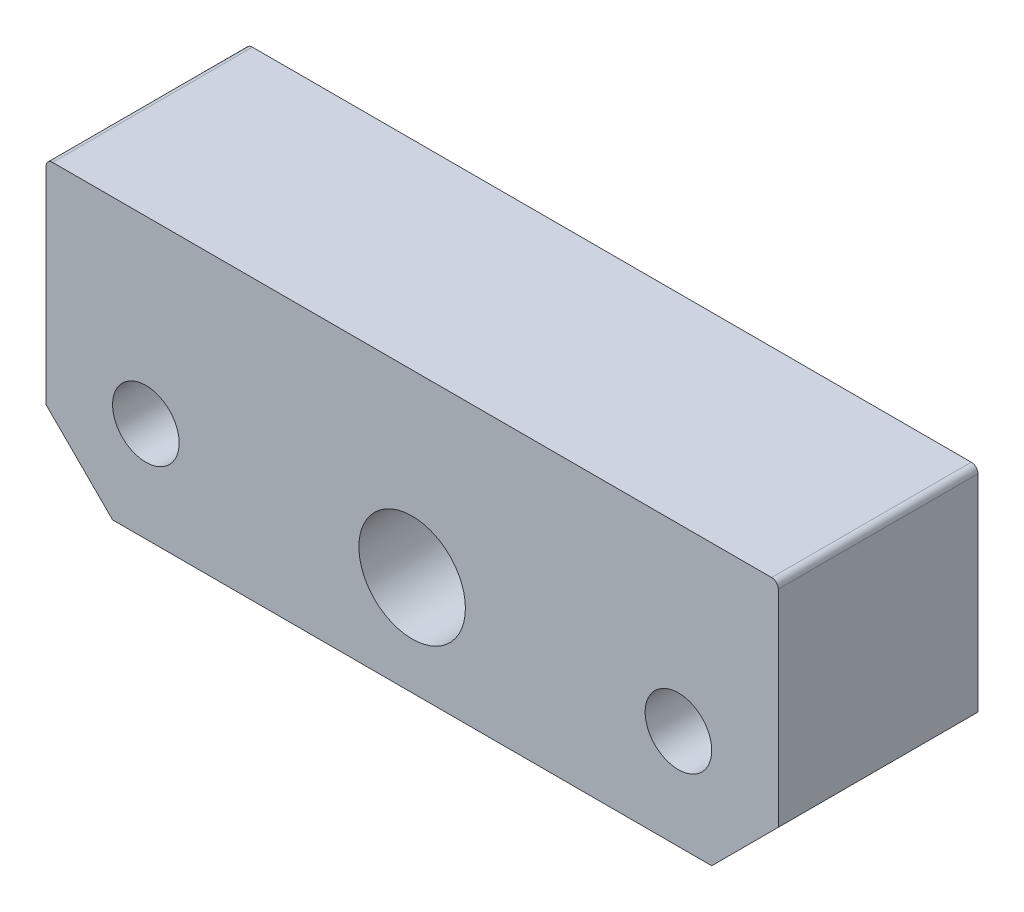
ISO-10303-21;
HEADER;
FILE_DESCRIPTION(('STEP AP214'),'2;1');
FILE_NAME('part.step','',(''),(''),'','','');
FILE_SCHEMA(('AUTOMOTIVE_DESIGN { 1 0 10303 214 1 1 1 1 }'));
ENDSEC;
DATA;
#1=APPLICATION_CONTEXT('core data for automotive mechanical design processes');
#2=APPLICATION_PROTOCOL_DEFINITION('international standard','automotive_design',2000,#1);
#3=PRODUCT_CONTEXT('',#1,'mechanical');
#4=PRODUCT('Part','Part','',(#3));
#5=PRODUCT_RELATED_PRODUCT_CATEGORY('part','',(#4));
#6=PRODUCT_DEFINITION_FORMATION('','',#4);
#7=PRODUCT_DEFINITION_CONTEXT('part definition',#1,'design');
#8=PRODUCT_DEFINITION('design','',#6,#7);
#9=PRODUCT_DEFINITION_SHAPE('','',#8);
#10=(LENGTH_UNIT() NAMED_UNIT(*) SI_UNIT(.MILLI.,.METRE.));
#11=(NAMED_UNIT(*) PLANE_ANGLE_UNIT() SI_UNIT($,.RADIAN.));
#12=(NAMED_UNIT(*) SI_UNIT($,.STERADIAN.) SOLID_ANGLE_UNIT());
#13=UNCERTAINTY_MEASURE_WITH_UNIT(LENGTH_MEASURE(1.E-05),#10,'distance_accuracy_value','');
#14=(GEOMETRIC_REPRESENTATION_CONTEXT(3) GLOBAL_UNCERTAINTY_ASSIGNED_CONTEXT((#13)) GLOBAL_UNIT_ASSIGNED_CONTEXT((#10,
#11,#12)) REPRESENTATION_CONTEXT('',''));
#15=CARTESIAN_POINT('',(0.,0.,0.));
#16=DIRECTION('',(0.,0.,1.));
#17=DIRECTION('',(1.,0.,0.));
#18=AXIS2_PLACEMENT_3D('',#15,#16,#17);
#19=CARTESIAN_POINT('',(55.,-21.,30.));
#20=DIRECTION('',(-1.,0.,0.));
#21=DIRECTION('',(0.,0.,1.));
#22=AXIS2_PLACEMENT_3D('',#19,#20,#21);
#23=PLANE('',#22);
#24=DIRECTION('',(0.,1.,0.));
#25=VECTOR('',#24,1.);
#26=CARTESIAN_POINT('',(55.,-21.,0.));
#27=LINE('',#26,#25);
#28=CARTESIAN_POINT('',(55.,-11.,0.));
#29=VERTEX_POINT('',#28);
#30=CARTESIAN_POINT('',(55.,20.,0.));
#31=VERTEX_POINT('',#30);
#32=EDGE_CURVE('E169',#29,#31,#27,.T.);
#33=ORIENTED_EDGE('',*,*,#32,.T.);
#34=DIRECTION('',(0.,0.,-1.));
#35=VECTOR('',#34,1.);
#36=CARTESIAN_POINT('',(55.,20.,30.));
#37=LINE('',#36,#35);
#38=CARTESIAN_POINT('',(55.,20.,30.));
#39=VERTEX_POINT('',#38);
#40=EDGE_CURVE('E11',#31,#39,#37,.F.);
#41=ORIENTED_EDGE('',*,*,#40,.T.);
#42=DIRECTION('',(0.,1.,0.));
#43=VECTOR('',#42,1.);
#44=CARTESIAN_POINT('',(55.,-21.,30.));
#45=LINE('',#44,#43);
#46=CARTESIAN_POINT('',(55.,-11.,30.));
#47=VERTEX_POINT('',#46);
#48=EDGE_CURVE('E124',#47,#39,#45,.T.);
#49=ORIENTED_EDGE('',*,*,#48,.F.);
#50=DIRECTION('',(0.,0.,-1.));
#51=VECTOR('',#50,1.);
#52=CARTESIAN_POINT('',(55.,-11.,30.));
#53=LINE('',#52,#51);
#54=EDGE_CURVE('E140',#47,#29,#53,.T.);
#55=ORIENTED_EDGE('',*,*,#54,.T.);
#56=EDGE_LOOP('',(#33,#41,#49,#55));
#57=FACE_BOUND('',#56,.T.);
#58=ADVANCED_FACE('F32',(#57),#23,.F.);
#59=CARTESIAN_POINT('',(-55.,21.,30.));
#60=DIRECTION('',(0.,-1.,0.));
#61=DIRECTION('',(0.,0.,-1.));
#62=AXIS2_PLACEMENT_3D('',#59,#60,#61);
#63=PLANE('',#62);
#64=DIRECTION('',(-1.,0.,0.));
#65=VECTOR('',#64,1.);
#66=CARTESIAN_POINT('',(-55.,21.,0.));
#67=LINE('',#66,#65);
#68=CARTESIAN_POINT('',(54.,21.,0.));
#69=VERTEX_POINT('',#68);
#70=CARTESIAN_POINT('',(-54.,21.,0.));
#71=VERTEX_POINT('',#70);
#72=EDGE_CURVE('E129',#69,#71,#67,.T.);
#73=ORIENTED_EDGE('',*,*,#72,.T.);
#74=DIRECTION('',(0.,0.,-1.));
#75=VECTOR('',#74,1.);
#76=CARTESIAN_POINT('',(-54.,21.,30.));
#77=LINE('',#76,#75);
#78=CARTESIAN_POINT('',(-54.,21.,30.));
#79=VERTEX_POINT('',#78);
#80=EDGE_CURVE('E53',#71,#79,#77,.F.);
#81=ORIENTED_EDGE('',*,*,#80,.T.);
#82=DIRECTION('',(-1.,0.,0.));
#83=VECTOR('',#82,1.);
#84=CARTESIAN_POINT('',(-55.,21.,30.));
#85=LINE('',#84,#83);
#86=CARTESIAN_POINT('',(54.,21.,30.));
#87=VERTEX_POINT('',#86);
#88=EDGE_CURVE('E127',#87,#79,#85,.T.);
#89=ORIENTED_EDGE('',*,*,#88,.F.);
#90=DIRECTION('',(0.,0.,-1.));
#91=VECTOR('',#90,1.);
#92=CARTESIAN_POINT('',(54.,21.,30.));
#93=LINE('',#92,#91);
#94=EDGE_CURVE('E150',#87,#69,#93,.T.);
#95=ORIENTED_EDGE('',*,*,#94,.T.);
#96=EDGE_LOOP('',(#73,#81,#89,#95));
#97=FACE_BOUND('',#96,.T.);
#98=ADVANCED_FACE('F167',(#97),#63,.F.);
#99=CARTESIAN_POINT('',(-55.,-21.,30.));
#100=DIRECTION('',(1.,0.,0.));
#101=DIRECTION('',(0.,0.,-1.));
#102=AXIS2_PLACEMENT_3D('',#99,#100,#101);
#103=PLANE('',#102);
#104=DIRECTION('',(0.,-1.,0.));
#105=VECTOR('',#104,1.);
#106=CARTESIAN_POINT('',(-55.,-21.,30.));
#107=LINE('',#106,#105);
#108=CARTESIAN_POINT('',(-55.,20.,30.));
#109=VERTEX_POINT('',#108);
#110=CARTESIAN_POINT('',(-55.,-11.,30.));
#111=VERTEX_POINT('',#110);
#112=EDGE_CURVE('E159',#109,#111,#107,.T.);
#113=ORIENTED_EDGE('',*,*,#112,.F.);
#114=DIRECTION('',(0.,0.,-1.));
#115=VECTOR('',#114,1.);
#116=CARTESIAN_POINT('',(-55.,20.,30.));
#117=LINE('',#116,#115);
#118=CARTESIAN_POINT('',(-55.,20.,0.));
#119=VERTEX_POINT('',#118);
#120=EDGE_CURVE('E143',#109,#119,#117,.T.);
#121=ORIENTED_EDGE('',*,*,#120,.T.);
#122=DIRECTION('',(0.,-1.,0.));
#123=VECTOR('',#122,1.);
#124=CARTESIAN_POINT('',(-55.,-21.,0.));
#125=LINE('',#124,#123);
#126=CARTESIAN_POINT('',(-55.,-11.,0.));
#127=VERTEX_POINT('',#126);
#128=EDGE_CURVE('E125',#119,#127,#125,.T.);
#129=ORIENTED_EDGE('',*,*,#128,.T.);
#130=DIRECTION('',(0.,0.,1.));
#131=VECTOR('',#130,1.);
#132=CARTESIAN_POINT('',(-55.,-10.9999999999999,30.));
#133=LINE('',#132,#131);
#134=EDGE_CURVE('E106',#127,#111,#133,.T.);
#135=ORIENTED_EDGE('',*,*,#134,.T.);
#136=EDGE_LOOP('',(#113,#121,#129,#135));
#137=FACE_BOUND('',#136,.T.);
#138=ADVANCED_FACE('F163',(#137),#103,.F.);
#139=CARTESIAN_POINT('',(-55.,-21.,30.));
#140=DIRECTION('',(0.,1.,0.));
#141=DIRECTION('',(0.,0.,1.));
#142=AXIS2_PLACEMENT_3D('',#139,#140,#141);
#143=PLANE('',#142);
#144=DIRECTION('',(1.,0.,0.));
#145=VECTOR('',#144,1.);
#146=CARTESIAN_POINT('',(-55.,-21.,30.));
#147=LINE('',#146,#145);
#148=CARTESIAN_POINT('',(-45.,-21.,30.));
#149=VERTEX_POINT('',#148);
#150=CARTESIAN_POINT('',(45.,-21.,30.));
#151=VERTEX_POINT('',#150);
#152=EDGE_CURVE('E119',#149,#151,#147,.T.);
#153=ORIENTED_EDGE('',*,*,#152,.F.);
#154=DIRECTION('',(0.,0.,-1.));
#155=VECTOR('',#154,1.);
#156=CARTESIAN_POINT('',(-45.,-21.,30.));
#157=LINE('',#156,#155);
#158=CARTESIAN_POINT('',(-45.,-21.,0.));
#159=VERTEX_POINT('',#158);
#160=EDGE_CURVE('E104',#149,#159,#157,.T.);
#161=ORIENTED_EDGE('',*,*,#160,.T.);
#162=DIRECTION('',(1.,0.,0.));
#163=VECTOR('',#162,1.);
#164=CARTESIAN_POINT('',(-55.,-21.,0.));
#165=LINE('',#164,#163);
#166=CARTESIAN_POINT('',(45.,-21.,0.));
#167=VERTEX_POINT('',#166);
#168=EDGE_CURVE('E116',#159,#167,#165,.T.);
#169=ORIENTED_EDGE('',*,*,#168,.T.);
#170=DIRECTION('',(0.,0.,1.));
#171=VECTOR('',#170,1.);
#172=CARTESIAN_POINT('',(45.,-21.,30.));
#173=LINE('',#172,#171);
#174=EDGE_CURVE('E120',#167,#151,#173,.T.);
#175=ORIENTED_EDGE('',*,*,#174,.T.);
#176=EDGE_LOOP('',(#153,#161,#169,#175));
#177=FACE_BOUND('',#176,.T.);
#178=ADVANCED_FACE('F115',(#177),#143,.F.);
#179=CARTESIAN_POINT('',(0.,0.,30.));
#180=DIRECTION('',(0.,0.,-1.));
#181=DIRECTION('',(-1.,0.,0.));
#182=AXIS2_PLACEMENT_3D('',#179,#180,#181);
#183=PLANE('',#182);
#184=CARTESIAN_POINT('',(40.,-5.99999999999999,30.));
#185=DIRECTION('',(0.,0.,1.));
#186=DIRECTION('',(1.,0.,0.));
#187=AXIS2_PLACEMENT_3D('',#184,#185,#186);
#188=CIRCLE('',#187,5.);
#189=CARTESIAN_POINT('',(45.,-5.99999999999999,30.));
#190=VERTEX_POINT('',#189);
#191=EDGE_CURVE('E187',#190,#190,#188,.T.);
#192=ORIENTED_EDGE('',*,*,#191,.F.);
#193=EDGE_LOOP('',(#192));
#194=FACE_BOUND('',#193,.T.);
#195=CARTESIAN_POINT('',(0.,-5.99999999999999,30.));
#196=DIRECTION('',(0.,0.,1.));
#197=DIRECTION('',(1.,0.,0.));
#198=AXIS2_PLACEMENT_3D('',#195,#196,#197);
#199=CIRCLE('',#198,8.);
#200=CARTESIAN_POINT('',(8.,-5.99999999999999,30.));
#201=VERTEX_POINT('',#200);
#202=EDGE_CURVE('E181',#201,#201,#199,.T.);
#203=ORIENTED_EDGE('',*,*,#202,.F.);
#204=EDGE_LOOP('',(#203));
#205=FACE_BOUND('',#204,.T.);
#206=CARTESIAN_POINT('',(-40.,-5.99999999999999,30.));
#207=DIRECTION('',(0.,0.,1.));
#208=DIRECTION('',(1.,0.,0.));
#209=AXIS2_PLACEMENT_3D('',#206,#207,#208);
#210=CIRCLE('',#209,5.);
#211=CARTESIAN_POINT('',(-35.,-5.99999999999999,30.));
#212=VERTEX_POINT('',#211);
#213=EDGE_CURVE('E175',#212,#212,#210,.T.);
#214=ORIENTED_EDGE('',*,*,#213,.F.);
#215=EDGE_LOOP('',(#214));
#216=FACE_BOUND('',#215,.T.);
#217=ORIENTED_EDGE('',*,*,#88,.T.);
#218=CARTESIAN_POINT('',(-54.,20.,30.));
#219=DIRECTION('',(0.,0.,-1.));
#220=DIRECTION('',(-1.,0.,0.));
#221=AXIS2_PLACEMENT_3D('',#218,#219,#220);
#222=CIRCLE('',#221,1.);
#223=EDGE_CURVE('E40',#79,#109,#222,.F.);
#224=ORIENTED_EDGE('',*,*,#223,.T.);
#225=ORIENTED_EDGE('',*,*,#112,.T.);
#226=DIRECTION('',(-0.707106781186546,0.707106781186549,0.));
#227=VECTOR('',#226,1.);
#228=CARTESIAN_POINT('',(-45.,-21.,30.));
#229=LINE('',#228,#227);
#230=EDGE_CURVE('E138',#111,#149,#229,.F.);
#231=ORIENTED_EDGE('',*,*,#230,.T.);
#232=ORIENTED_EDGE('',*,*,#152,.T.);
#233=DIRECTION('',(-0.707106781186549,-0.707106781186546,0.));
#234=VECTOR('',#233,1.);
#235=CARTESIAN_POINT('',(55.,-11.,30.));
#236=LINE('',#235,#234);
#237=EDGE_CURVE('E136',#151,#47,#236,.F.);
#238=ORIENTED_EDGE('',*,*,#237,.T.);
#239=ORIENTED_EDGE('',*,*,#48,.T.);
#240=CARTESIAN_POINT('',(54.,20.,30.));
#241=DIRECTION('',(0.,0.,-1.));
#242=DIRECTION('',(-1.,0.,0.));
#243=AXIS2_PLACEMENT_3D('',#240,#241,#242);
#244=CIRCLE('',#243,1.);
#245=EDGE_CURVE('E154',#39,#87,#244,.F.);
#246=ORIENTED_EDGE('',*,*,#245,.T.);
#247=EDGE_LOOP('',(#217,#224,#225,#231,#232,#238,#239,#246));
#248=FACE_BOUND('',#247,.T.);
#249=ADVANCED_FACE('F158',(#194,#205,#216,#248),#183,.F.);
#250=CARTESIAN_POINT('',(0.,0.,0.));
#251=DIRECTION('',(0.,0.,-1.));
#252=DIRECTION('',(-1.,0.,0.));
#253=AXIS2_PLACEMENT_3D('',#250,#251,#252);
#254=PLANE('',#253);
#255=CARTESIAN_POINT('',(40.,-5.99999999999999,0.));
#256=DIRECTION('',(0.,0.,1.));
#257=DIRECTION('',(1.,0.,0.));
#258=AXIS2_PLACEMENT_3D('',#255,#256,#257);
#259=CIRCLE('',#258,5.);
#260=CARTESIAN_POINT('',(45.,-5.99999999999999,0.));
#261=VERTEX_POINT('',#260);
#262=EDGE_CURVE('E178',#261,#261,#259,.T.);
#263=ORIENTED_EDGE('',*,*,#262,.T.);
#264=EDGE_LOOP('',(#263));
#265=FACE_BOUND('',#264,.T.);
#266=CARTESIAN_POINT('',(0.,-5.99999999999999,0.));
#267=DIRECTION('',(0.,0.,1.));
#268=DIRECTION('',(1.,0.,0.));
#269=AXIS2_PLACEMENT_3D('',#266,#267,#268);
#270=CIRCLE('',#269,8.);
#271=CARTESIAN_POINT('',(8.,-5.99999999999999,0.));
#272=VERTEX_POINT('',#271);
#273=EDGE_CURVE('E184',#272,#272,#270,.T.);
#274=ORIENTED_EDGE('',*,*,#273,.T.);
#275=EDGE_LOOP('',(#274));
#276=FACE_BOUND('',#275,.T.);
#277=CARTESIAN_POINT('',(-40.,-5.99999999999999,0.));
#278=DIRECTION('',(0.,0.,1.));
#279=DIRECTION('',(1.,0.,0.));
#280=AXIS2_PLACEMENT_3D('',#277,#278,#279);
#281=CIRCLE('',#280,5.);
#282=CARTESIAN_POINT('',(-35.,-5.99999999999999,0.));
#283=VERTEX_POINT('',#282);
#284=EDGE_CURVE('E170',#283,#283,#281,.T.);
#285=ORIENTED_EDGE('',*,*,#284,.T.);
#286=EDGE_LOOP('',(#285));
#287=FACE_BOUND('',#286,.T.);
#288=ORIENTED_EDGE('',*,*,#128,.F.);
#289=CARTESIAN_POINT('',(-54.,20.,0.));
#290=DIRECTION('',(0.,0.,-1.));
#291=DIRECTION('',(-1.,0.,0.));
#292=AXIS2_PLACEMENT_3D('',#289,#290,#291);
#293=CIRCLE('',#292,1.);
#294=EDGE_CURVE('E148',#119,#71,#293,.T.);
#295=ORIENTED_EDGE('',*,*,#294,.T.);
#296=ORIENTED_EDGE('',*,*,#72,.F.);
#297=CARTESIAN_POINT('',(54.,20.,0.));
#298=DIRECTION('',(0.,0.,-1.));
#299=DIRECTION('',(-1.,0.,0.));
#300=AXIS2_PLACEMENT_3D('',#297,#298,#299);
#301=CIRCLE('',#300,1.);
#302=EDGE_CURVE('E146',#69,#31,#301,.T.);
#303=ORIENTED_EDGE('',*,*,#302,.T.);
#304=ORIENTED_EDGE('',*,*,#32,.F.);
#305=DIRECTION('',(0.707106781186549,0.707106781186546,0.));
#306=VECTOR('',#305,1.);
#307=CARTESIAN_POINT('',(32.9999999999999,-33.,0.));
#308=LINE('',#307,#306);
#309=EDGE_CURVE('E110',#29,#167,#308,.F.);
#310=ORIENTED_EDGE('',*,*,#309,.T.);
#311=ORIENTED_EDGE('',*,*,#168,.F.);
#312=DIRECTION('',(0.707106781186546,-0.707106781186549,0.));
#313=VECTOR('',#312,1.);
#314=CARTESIAN_POINT('',(-33.0000000000001,-32.9999999999999,0.));
#315=LINE('',#314,#313);
#316=EDGE_CURVE('E100',#159,#127,#315,.F.);
#317=ORIENTED_EDGE('',*,*,#316,.T.);
#318=EDGE_LOOP('',(#288,#295,#296,#303,#304,#310,#311,#317));
#319=FACE_BOUND('',#318,.T.);
#320=ADVANCED_FACE('F122',(#265,#276,#287,#319),#254,.T.);
#321=CARTESIAN_POINT('',(-45.,-21.,30.));
#322=DIRECTION('',(0.707106781186549,0.707106781186546,0.));
#323=DIRECTION('',(0.,0.,-1.));
#324=AXIS2_PLACEMENT_3D('',#321,#322,#323);
#325=PLANE('',#324);
#326=ORIENTED_EDGE('',*,*,#230,.F.);
#327=ORIENTED_EDGE('',*,*,#134,.F.);
#328=ORIENTED_EDGE('',*,*,#316,.F.);
#329=ORIENTED_EDGE('',*,*,#160,.F.);
#330=EDGE_LOOP('',(#326,#327,#328,#329));
#331=FACE_BOUND('',#330,.T.);
#332=ADVANCED_FACE('F103',(#331),#325,.F.);
#333=CARTESIAN_POINT('',(55.,-11.,30.));
#334=DIRECTION('',(-0.707106781186546,0.707106781186549,0.));
#335=DIRECTION('',(0.,0.,-1.));
#336=AXIS2_PLACEMENT_3D('',#333,#334,#335);
#337=PLANE('',#336);
#338=ORIENTED_EDGE('',*,*,#237,.F.);
#339=ORIENTED_EDGE('',*,*,#174,.F.);
#340=ORIENTED_EDGE('',*,*,#309,.F.);
#341=ORIENTED_EDGE('',*,*,#54,.F.);
#342=EDGE_LOOP('',(#338,#339,#340,#341));
#343=FACE_BOUND('',#342,.T.);
#344=ADVANCED_FACE('F231',(#343),#337,.F.);
#345=CARTESIAN_POINT('',(-54.,20.,30.));
#346=DIRECTION('',(0.,0.,-1.));
#347=DIRECTION('',(-1.,0.,0.));
#348=AXIS2_PLACEMENT_3D('',#345,#346,#347);
#349=CYLINDRICAL_SURFACE('',#348,1.);
#350=ORIENTED_EDGE('',*,*,#223,.F.);
#351=ORIENTED_EDGE('',*,*,#80,.F.);
#352=ORIENTED_EDGE('',*,*,#294,.F.);
#353=ORIENTED_EDGE('',*,*,#120,.F.);
#354=EDGE_LOOP('',(#350,#351,#352,#353));
#355=FACE_BOUND('',#354,.T.);
#356=ADVANCED_FACE('F165',(#355),#349,.T.);
#357=CARTESIAN_POINT('',(54.,20.,30.));
#358=DIRECTION('',(0.,0.,-1.));
#359=DIRECTION('',(-1.,0.,0.));
#360=AXIS2_PLACEMENT_3D('',#357,#358,#359);
#361=CYLINDRICAL_SURFACE('',#360,1.);
#362=ORIENTED_EDGE('',*,*,#245,.F.);
#363=ORIENTED_EDGE('',*,*,#40,.F.);
#364=ORIENTED_EDGE('',*,*,#302,.F.);
#365=ORIENTED_EDGE('',*,*,#94,.F.);
#366=EDGE_LOOP('',(#362,#363,#364,#365));
#367=FACE_BOUND('',#366,.T.);
#368=ADVANCED_FACE('F34',(#367),#361,.T.);
#369=CARTESIAN_POINT('',(-40.,-5.99999999999999,0.));
#370=DIRECTION('',(0.,0.,1.));
#371=DIRECTION('',(1.,0.,0.));
#372=AXIS2_PLACEMENT_3D('',#369,#370,#371);
#373=CYLINDRICAL_SURFACE('',#372,5.);
#374=ORIENTED_EDGE('',*,*,#284,.F.);
#375=EDGE_LOOP('',(#374));
#376=FACE_BOUND('',#375,.T.);
#377=ORIENTED_EDGE('',*,*,#213,.T.);
#378=EDGE_LOOP('',(#377));
#379=FACE_BOUND('',#378,.T.);
#380=ADVANCED_FACE('F209',(#376,#379),#373,.F.);
#381=CARTESIAN_POINT('',(0.,-5.99999999999999,0.));
#382=DIRECTION('',(0.,0.,1.));
#383=DIRECTION('',(1.,0.,0.));
#384=AXIS2_PLACEMENT_3D('',#381,#382,#383);
#385=CYLINDRICAL_SURFACE('',#384,8.);
#386=ORIENTED_EDGE('',*,*,#273,.F.);
#387=EDGE_LOOP('',(#386));
#388=FACE_BOUND('',#387,.T.);
#389=ORIENTED_EDGE('',*,*,#202,.T.);
#390=EDGE_LOOP('',(#389));
#391=FACE_BOUND('',#390,.T.);
#392=ADVANCED_FACE('F198',(#388,#391),#385,.F.);
#393=CARTESIAN_POINT('',(40.,-5.99999999999999,0.));
#394=DIRECTION('',(0.,0.,1.));
#395=DIRECTION('',(1.,0.,0.));
#396=AXIS2_PLACEMENT_3D('',#393,#394,#395);
#397=CYLINDRICAL_SURFACE('',#396,5.);
#398=ORIENTED_EDGE('',*,*,#262,.F.);
#399=EDGE_LOOP('',(#398));
#400=FACE_BOUND('',#399,.T.);
#401=ORIENTED_EDGE('',*,*,#191,.T.);
#402=EDGE_LOOP('',(#401));
#403=FACE_BOUND('',#402,.T.);
#404=ADVANCED_FACE('F195',(#400,#403),#397,.F.);
#405=CLOSED_SHELL('',(#58,#98,#138,#178,#249,#320,#332,#344,#356,#368,#380,#392,#404));
#406=MANIFOLD_SOLID_BREP('B2',#405);
#407=ADVANCED_BREP_SHAPE_REPRESENTATION('',(#18,#406),#14);
#408=SHAPE_DEFINITION_REPRESENTATION(#9,#407);
ENDSEC;
END-ISO-10303-21;
